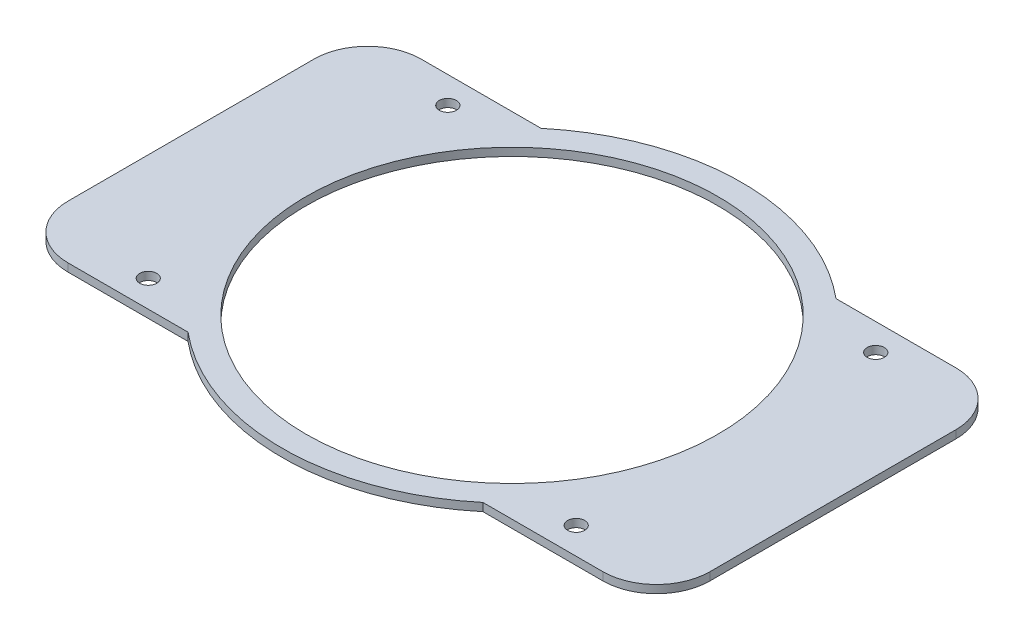
ISO-10303-21;
HEADER;
FILE_DESCRIPTION(('STEP AP214'),'2;1');
FILE_NAME('part.step','',(''),(''),'','','');
FILE_SCHEMA(('AUTOMOTIVE_DESIGN { 1 0 10303 214 1 1 1 1 }'));
ENDSEC;
DATA;
#1=APPLICATION_CONTEXT('core data for automotive mechanical design processes');
#2=APPLICATION_PROTOCOL_DEFINITION('international standard','automotive_design',2000,#1);
#3=PRODUCT_CONTEXT('',#1,'mechanical');
#4=PRODUCT('Part','Part','',(#3));
#5=PRODUCT_RELATED_PRODUCT_CATEGORY('part','',(#4));
#6=PRODUCT_DEFINITION_FORMATION('','',#4);
#7=PRODUCT_DEFINITION_CONTEXT('part definition',#1,'design');
#8=PRODUCT_DEFINITION('design','',#6,#7);
#9=PRODUCT_DEFINITION_SHAPE('','',#8);
#10=(LENGTH_UNIT() NAMED_UNIT(*) SI_UNIT(.MILLI.,.METRE.));
#11=(NAMED_UNIT(*) PLANE_ANGLE_UNIT() SI_UNIT($,.RADIAN.));
#12=(NAMED_UNIT(*) SI_UNIT($,.STERADIAN.) SOLID_ANGLE_UNIT());
#13=UNCERTAINTY_MEASURE_WITH_UNIT(LENGTH_MEASURE(1.E-05),#10,'distance_accuracy_value','');
#14=(GEOMETRIC_REPRESENTATION_CONTEXT(3) GLOBAL_UNCERTAINTY_ASSIGNED_CONTEXT((#13)) GLOBAL_UNIT_ASSIGNED_CONTEXT((#10,
#11,#12)) REPRESENTATION_CONTEXT('',''));
#15=CARTESIAN_POINT('',(0.,0.,0.));
#16=DIRECTION('',(0.,0.,1.));
#17=DIRECTION('',(1.,0.,0.));
#18=AXIS2_PLACEMENT_3D('',#15,#16,#17);
#19=CARTESIAN_POINT('',(0.,1.5,0.));
#20=DIRECTION('',(0.,1.,0.));
#21=DIRECTION('',(0.,0.,1.));
#22=AXIS2_PLACEMENT_3D('',#19,#20,#21);
#23=PLANE('',#22);
#24=CARTESIAN_POINT('',(-40.,1.5,-28.));
#25=DIRECTION('',(0.,1.,0.));
#26=DIRECTION('',(0.,0.,-1.));
#27=AXIS2_PLACEMENT_3D('',#24,#25,#26);
#28=CIRCLE('',#27,1.6);
#29=CARTESIAN_POINT('',(-40.,1.5,-29.6));
#30=VERTEX_POINT('',#29);
#31=EDGE_CURVE('E501',#30,#30,#28,.T.);
#32=ORIENTED_EDGE('',*,*,#31,.F.);
#33=EDGE_LOOP('',(#32));
#34=FACE_BOUND('',#33,.T.);
#35=CARTESIAN_POINT('',(-40.,1.5,28.));
#36=DIRECTION('',(0.,1.,0.));
#37=DIRECTION('',(0.,0.,1.));
#38=AXIS2_PLACEMENT_3D('',#35,#36,#37);
#39=CIRCLE('',#38,1.6);
#40=CARTESIAN_POINT('',(-40.,1.5,29.6));
#41=VERTEX_POINT('',#40);
#42=EDGE_CURVE('E495',#41,#41,#39,.T.);
#43=ORIENTED_EDGE('',*,*,#42,.F.);
#44=EDGE_LOOP('',(#43));
#45=FACE_BOUND('',#44,.T.);
#46=CARTESIAN_POINT('',(40.,1.5,28.));
#47=DIRECTION('',(0.,1.,0.));
#48=DIRECTION('',(0.,0.,-1.));
#49=AXIS2_PLACEMENT_3D('',#46,#47,#48);
#50=CIRCLE('',#49,1.6);
#51=CARTESIAN_POINT('',(40.,1.5,26.4));
#52=VERTEX_POINT('',#51);
#53=EDGE_CURVE('E485',#52,#52,#50,.T.);
#54=ORIENTED_EDGE('',*,*,#53,.F.);
#55=EDGE_LOOP('',(#54));
#56=FACE_BOUND('',#55,.T.);
#57=CARTESIAN_POINT('',(40.,1.5,-28.));
#58=DIRECTION('',(0.,1.,0.));
#59=DIRECTION('',(0.,0.,1.));
#60=AXIS2_PLACEMENT_3D('',#57,#58,#59);
#61=CIRCLE('',#60,1.6);
#62=CARTESIAN_POINT('',(40.,1.5,-26.4));
#63=VERTEX_POINT('',#62);
#64=EDGE_CURVE('E236',#63,#63,#61,.T.);
#65=ORIENTED_EDGE('',*,*,#64,.F.);
#66=EDGE_LOOP('',(#65));
#67=FACE_BOUND('',#66,.T.);
#68=DIRECTION('',(1.,0.,0.));
#69=VECTOR('',#68,1.);
#70=CARTESIAN_POINT('',(60.,1.5,33.));
#71=LINE('',#70,#69);
#72=CARTESIAN_POINT('',(27.5680975041804,1.5,33.));
#73=VERTEX_POINT('',#72);
#74=CARTESIAN_POINT('',(50.,1.5,33.));
#75=VERTEX_POINT('',#74);
#76=EDGE_CURVE('E159',#73,#75,#71,.T.);
#77=ORIENTED_EDGE('',*,*,#76,.T.);
#78=CARTESIAN_POINT('',(50.,1.5,23.));
#79=DIRECTION('',(0.,1.,0.));
#80=DIRECTION('',(0.,0.,1.));
#81=AXIS2_PLACEMENT_3D('',#78,#79,#80);
#82=CIRCLE('',#81,10.);
#83=CARTESIAN_POINT('',(60.,1.5,23.));
#84=VERTEX_POINT('',#83);
#85=EDGE_CURVE('E193',#75,#84,#82,.T.);
#86=ORIENTED_EDGE('',*,*,#85,.T.);
#87=DIRECTION('',(0.,0.,-1.));
#88=VECTOR('',#87,1.);
#89=CARTESIAN_POINT('',(60.,1.5,-32.));
#90=LINE('',#89,#88);
#91=CARTESIAN_POINT('',(60.,1.5,-23.));
#92=VERTEX_POINT('',#91);
#93=EDGE_CURVE('E167',#84,#92,#90,.T.);
#94=ORIENTED_EDGE('',*,*,#93,.T.);
#95=CARTESIAN_POINT('',(50.,1.5,-23.));
#96=DIRECTION('',(0.,1.,0.));
#97=DIRECTION('',(0.,0.,1.));
#98=AXIS2_PLACEMENT_3D('',#95,#96,#97);
#99=CIRCLE('',#98,10.);
#100=CARTESIAN_POINT('',(50.,1.5,-33.));
#101=VERTEX_POINT('',#100);
#102=EDGE_CURVE('E191',#92,#101,#99,.T.);
#103=ORIENTED_EDGE('',*,*,#102,.T.);
#104=DIRECTION('',(-1.,0.,0.));
#105=VECTOR('',#104,1.);
#106=CARTESIAN_POINT('',(60.,1.5,-33.));
#107=LINE('',#106,#105);
#108=CARTESIAN_POINT('',(27.5680975041804,1.5,-33.));
#109=VERTEX_POINT('',#108);
#110=EDGE_CURVE('E151',#101,#109,#107,.T.);
#111=ORIENTED_EDGE('',*,*,#110,.T.);
#112=CARTESIAN_POINT('',(0.,1.5,0.));
#113=DIRECTION('',(0.,1.,0.));
#114=DIRECTION('',(0.,0.,1.));
#115=AXIS2_PLACEMENT_3D('',#112,#113,#114);
#116=CIRCLE('',#115,43.);
#117=CARTESIAN_POINT('',(-27.5680975041804,1.5,-33.));
#118=VERTEX_POINT('',#117);
#119=EDGE_CURVE('E141',#109,#118,#116,.T.);
#120=ORIENTED_EDGE('',*,*,#119,.T.);
#121=DIRECTION('',(-1.,0.,0.));
#122=VECTOR('',#121,1.);
#123=CARTESIAN_POINT('',(-60.,1.5,-33.));
#124=LINE('',#123,#122);
#125=CARTESIAN_POINT('',(-50.,1.5,-33.));
#126=VERTEX_POINT('',#125);
#127=EDGE_CURVE('E222',#118,#126,#124,.T.);
#128=ORIENTED_EDGE('',*,*,#127,.T.);
#129=CARTESIAN_POINT('',(-50.,1.5,-23.));
#130=DIRECTION('',(0.,1.,0.));
#131=DIRECTION('',(0.,0.,1.));
#132=AXIS2_PLACEMENT_3D('',#129,#130,#131);
#133=CIRCLE('',#132,10.);
#134=CARTESIAN_POINT('',(-60.,1.5,-23.));
#135=VERTEX_POINT('',#134);
#136=EDGE_CURVE('E189',#126,#135,#133,.T.);
#137=ORIENTED_EDGE('',*,*,#136,.T.);
#138=DIRECTION('',(0.,0.,1.));
#139=VECTOR('',#138,1.);
#140=CARTESIAN_POINT('',(-60.,1.5,-32.));
#141=LINE('',#140,#139);
#142=CARTESIAN_POINT('',(-60.,1.5,23.));
#143=VERTEX_POINT('',#142);
#144=EDGE_CURVE('E145',#135,#143,#141,.T.);
#145=ORIENTED_EDGE('',*,*,#144,.T.);
#146=CARTESIAN_POINT('',(-50.,1.5,23.));
#147=DIRECTION('',(0.,1.,0.));
#148=DIRECTION('',(0.,0.,1.));
#149=AXIS2_PLACEMENT_3D('',#146,#147,#148);
#150=CIRCLE('',#149,10.);
#151=CARTESIAN_POINT('',(-50.,1.5,33.));
#152=VERTEX_POINT('',#151);
#153=EDGE_CURVE('E187',#143,#152,#150,.T.);
#154=ORIENTED_EDGE('',*,*,#153,.T.);
#155=DIRECTION('',(1.,0.,0.));
#156=VECTOR('',#155,1.);
#157=CARTESIAN_POINT('',(-60.,1.5,33.));
#158=LINE('',#157,#156);
#159=CARTESIAN_POINT('',(-27.5680975041804,1.5,33.));
#160=VERTEX_POINT('',#159);
#161=EDGE_CURVE('E229',#152,#160,#158,.T.);
#162=ORIENTED_EDGE('',*,*,#161,.T.);
#163=CARTESIAN_POINT('',(0.,1.5,0.));
#164=DIRECTION('',(0.,1.,0.));
#165=DIRECTION('',(0.,0.,1.));
#166=AXIS2_PLACEMENT_3D('',#163,#164,#165);
#167=CIRCLE('',#166,43.);
#168=EDGE_CURVE('E165',#160,#73,#167,.T.);
#169=ORIENTED_EDGE('',*,*,#168,.T.);
#170=EDGE_LOOP('',(#77,#86,#94,#103,#111,#120,#128,#137,#145,#154,#162,#169));
#171=FACE_BOUND('',#170,.T.);
#172=CARTESIAN_POINT('',(0.,1.5,0.));
#173=DIRECTION('',(0.,1.,0.));
#174=DIRECTION('',(0.,0.,1.));
#175=AXIS2_PLACEMENT_3D('',#172,#173,#174);
#176=CIRCLE('',#175,38.5);
#177=CARTESIAN_POINT('',(0.,1.5,38.5));
#178=VERTEX_POINT('',#177);
#179=EDGE_CURVE('E154',#178,#178,#176,.T.);
#180=ORIENTED_EDGE('',*,*,#179,.F.);
#181=EDGE_LOOP('',(#180));
#182=FACE_BOUND('',#181,.T.);
#183=ADVANCED_FACE('F33',(#34,#45,#56,#67,#171,#182),#23,.T.);
#184=CARTESIAN_POINT('',(0.,0.,0.));
#185=DIRECTION('',(0.,1.,0.));
#186=DIRECTION('',(0.,0.,1.));
#187=AXIS2_PLACEMENT_3D('',#184,#185,#186);
#188=PLANE('',#187);
#189=CARTESIAN_POINT('',(-40.,0.,-28.));
#190=DIRECTION('',(0.,1.,0.));
#191=DIRECTION('',(0.,0.,-1.));
#192=AXIS2_PLACEMENT_3D('',#189,#190,#191);
#193=CIRCLE('',#192,1.6);
#194=CARTESIAN_POINT('',(-40.,0.,-29.6));
#195=VERTEX_POINT('',#194);
#196=EDGE_CURVE('E498',#195,#195,#193,.T.);
#197=ORIENTED_EDGE('',*,*,#196,.T.);
#198=EDGE_LOOP('',(#197));
#199=FACE_BOUND('',#198,.T.);
#200=CARTESIAN_POINT('',(-40.,0.,28.));
#201=DIRECTION('',(0.,1.,0.));
#202=DIRECTION('',(0.,0.,1.));
#203=AXIS2_PLACEMENT_3D('',#200,#201,#202);
#204=CIRCLE('',#203,1.6);
#205=CARTESIAN_POINT('',(-40.,0.,29.6));
#206=VERTEX_POINT('',#205);
#207=EDGE_CURVE('E490',#206,#206,#204,.T.);
#208=ORIENTED_EDGE('',*,*,#207,.T.);
#209=EDGE_LOOP('',(#208));
#210=FACE_BOUND('',#209,.T.);
#211=CARTESIAN_POINT('',(40.,0.,28.));
#212=DIRECTION('',(0.,1.,0.));
#213=DIRECTION('',(0.,0.,-1.));
#214=AXIS2_PLACEMENT_3D('',#211,#212,#213);
#215=CIRCLE('',#214,1.6);
#216=CARTESIAN_POINT('',(40.,0.,26.4));
#217=VERTEX_POINT('',#216);
#218=EDGE_CURVE('E483',#217,#217,#215,.T.);
#219=ORIENTED_EDGE('',*,*,#218,.T.);
#220=EDGE_LOOP('',(#219));
#221=FACE_BOUND('',#220,.T.);
#222=CARTESIAN_POINT('',(40.,0.,-28.));
#223=DIRECTION('',(0.,1.,0.));
#224=DIRECTION('',(0.,0.,1.));
#225=AXIS2_PLACEMENT_3D('',#222,#223,#224);
#226=CIRCLE('',#225,1.6);
#227=CARTESIAN_POINT('',(40.,0.,-26.4));
#228=VERTEX_POINT('',#227);
#229=EDGE_CURVE('E233',#228,#228,#226,.T.);
#230=ORIENTED_EDGE('',*,*,#229,.T.);
#231=EDGE_LOOP('',(#230));
#232=FACE_BOUND('',#231,.T.);
#233=DIRECTION('',(0.,0.,-1.));
#234=VECTOR('',#233,1.);
#235=CARTESIAN_POINT('',(60.,0.,-32.));
#236=LINE('',#235,#234);
#237=CARTESIAN_POINT('',(60.,0.,23.));
#238=VERTEX_POINT('',#237);
#239=CARTESIAN_POINT('',(60.,0.,-23.));
#240=VERTEX_POINT('',#239);
#241=EDGE_CURVE('E134',#238,#240,#236,.T.);
#242=ORIENTED_EDGE('',*,*,#241,.F.);
#243=CARTESIAN_POINT('',(50.,0.,23.));
#244=DIRECTION('',(0.,1.,0.));
#245=DIRECTION('',(0.,0.,1.));
#246=AXIS2_PLACEMENT_3D('',#243,#244,#245);
#247=CIRCLE('',#246,10.);
#248=CARTESIAN_POINT('',(50.,0.,33.));
#249=VERTEX_POINT('',#248);
#250=EDGE_CURVE('E205',#238,#249,#247,.F.);
#251=ORIENTED_EDGE('',*,*,#250,.T.);
#252=DIRECTION('',(-1.,0.,0.));
#253=VECTOR('',#252,1.);
#254=CARTESIAN_POINT('',(60.,0.,33.));
#255=LINE('',#254,#253);
#256=CARTESIAN_POINT('',(27.5680975041804,0.,33.));
#257=VERTEX_POINT('',#256);
#258=EDGE_CURVE('E156',#249,#257,#255,.T.);
#259=ORIENTED_EDGE('',*,*,#258,.T.);
#260=CARTESIAN_POINT('',(0.,0.,0.));
#261=DIRECTION('',(0.,1.,0.));
#262=DIRECTION('',(0.,0.,1.));
#263=AXIS2_PLACEMENT_3D('',#260,#261,#262);
#264=CIRCLE('',#263,43.);
#265=CARTESIAN_POINT('',(-27.5680975041804,0.,33.));
#266=VERTEX_POINT('',#265);
#267=EDGE_CURVE('E163',#266,#257,#264,.T.);
#268=ORIENTED_EDGE('',*,*,#267,.F.);
#269=DIRECTION('',(-1.,0.,0.));
#270=VECTOR('',#269,1.);
#271=CARTESIAN_POINT('',(-60.,0.,33.));
#272=LINE('',#271,#270);
#273=CARTESIAN_POINT('',(-50.,0.,33.));
#274=VERTEX_POINT('',#273);
#275=EDGE_CURVE('E231',#266,#274,#272,.T.);
#276=ORIENTED_EDGE('',*,*,#275,.T.);
#277=CARTESIAN_POINT('',(-50.,0.,23.));
#278=DIRECTION('',(0.,1.,0.));
#279=DIRECTION('',(0.,0.,1.));
#280=AXIS2_PLACEMENT_3D('',#277,#278,#279);
#281=CIRCLE('',#280,10.);
#282=CARTESIAN_POINT('',(-60.,0.,23.));
#283=VERTEX_POINT('',#282);
#284=EDGE_CURVE('E48',#274,#283,#281,.F.);
#285=ORIENTED_EDGE('',*,*,#284,.T.);
#286=DIRECTION('',(0.,0.,1.));
#287=VECTOR('',#286,1.);
#288=CARTESIAN_POINT('',(-60.,0.,-32.));
#289=LINE('',#288,#287);
#290=CARTESIAN_POINT('',(-60.,0.,-23.));
#291=VERTEX_POINT('',#290);
#292=EDGE_CURVE('E133',#291,#283,#289,.T.);
#293=ORIENTED_EDGE('',*,*,#292,.F.);
#294=CARTESIAN_POINT('',(-50.,0.,-23.));
#295=DIRECTION('',(0.,1.,0.));
#296=DIRECTION('',(0.,0.,1.));
#297=AXIS2_PLACEMENT_3D('',#294,#295,#296);
#298=CIRCLE('',#297,10.);
#299=CARTESIAN_POINT('',(-50.,0.,-33.));
#300=VERTEX_POINT('',#299);
#301=EDGE_CURVE('E201',#291,#300,#298,.F.);
#302=ORIENTED_EDGE('',*,*,#301,.T.);
#303=DIRECTION('',(1.,0.,0.));
#304=VECTOR('',#303,1.);
#305=CARTESIAN_POINT('',(-60.,0.,-33.));
#306=LINE('',#305,#304);
#307=CARTESIAN_POINT('',(-27.5680975041804,0.,-33.));
#308=VERTEX_POINT('',#307);
#309=EDGE_CURVE('E130',#300,#308,#306,.T.);
#310=ORIENTED_EDGE('',*,*,#309,.T.);
#311=CARTESIAN_POINT('',(0.,0.,0.));
#312=DIRECTION('',(0.,1.,0.));
#313=DIRECTION('',(0.,0.,1.));
#314=AXIS2_PLACEMENT_3D('',#311,#312,#313);
#315=CIRCLE('',#314,43.);
#316=CARTESIAN_POINT('',(27.5680975041804,0.,-33.));
#317=VERTEX_POINT('',#316);
#318=EDGE_CURVE('E121',#317,#308,#315,.T.);
#319=ORIENTED_EDGE('',*,*,#318,.F.);
#320=DIRECTION('',(1.,0.,0.));
#321=VECTOR('',#320,1.);
#322=CARTESIAN_POINT('',(60.,0.,-33.));
#323=LINE('',#322,#321);
#324=CARTESIAN_POINT('',(50.,0.,-33.));
#325=VERTEX_POINT('',#324);
#326=EDGE_CURVE('E127',#317,#325,#323,.T.);
#327=ORIENTED_EDGE('',*,*,#326,.T.);
#328=CARTESIAN_POINT('',(50.,0.,-23.));
#329=DIRECTION('',(0.,1.,0.));
#330=DIRECTION('',(0.,0.,1.));
#331=AXIS2_PLACEMENT_3D('',#328,#329,#330);
#332=CIRCLE('',#331,10.);
#333=EDGE_CURVE('E203',#325,#240,#332,.F.);
#334=ORIENTED_EDGE('',*,*,#333,.T.);
#335=EDGE_LOOP('',(#242,#251,#259,#268,#276,#285,#293,#302,#310,#319,#327,#334));
#336=FACE_BOUND('',#335,.T.);
#337=CARTESIAN_POINT('',(0.,0.,0.));
#338=DIRECTION('',(0.,1.,0.));
#339=DIRECTION('',(0.,0.,1.));
#340=AXIS2_PLACEMENT_3D('',#337,#338,#339);
#341=CIRCLE('',#340,38.5);
#342=CARTESIAN_POINT('',(0.,0.,38.5));
#343=VERTEX_POINT('',#342);
#344=EDGE_CURVE('E150',#343,#343,#341,.T.);
#345=ORIENTED_EDGE('',*,*,#344,.T.);
#346=EDGE_LOOP('',(#345));
#347=FACE_BOUND('',#346,.T.);
#348=ADVANCED_FACE('F124',(#199,#210,#221,#232,#336,#347),#188,.F.);
#349=CARTESIAN_POINT('',(0.,1.5,0.));
#350=DIRECTION('',(0.,-1.,0.));
#351=DIRECTION('',(0.,0.,-1.));
#352=AXIS2_PLACEMENT_3D('',#349,#350,#351);
#353=CYLINDRICAL_SURFACE('',#352,43.);
#354=ORIENTED_EDGE('',*,*,#168,.F.);
#355=DIRECTION('',(0.,-1.,0.));
#356=VECTOR('',#355,1.);
#357=CARTESIAN_POINT('',(-27.5680975041804,1.5,33.));
#358=LINE('',#357,#356);
#359=EDGE_CURVE('E180',#160,#266,#358,.T.);
#360=ORIENTED_EDGE('',*,*,#359,.T.);
#361=ORIENTED_EDGE('',*,*,#267,.T.);
#362=DIRECTION('',(0.,-1.,0.));
#363=VECTOR('',#362,1.);
#364=CARTESIAN_POINT('',(27.5680975041804,1.5,33.));
#365=LINE('',#364,#363);
#366=EDGE_CURVE('E144',#257,#73,#365,.F.);
#367=ORIENTED_EDGE('',*,*,#366,.T.);
#368=EDGE_LOOP('',(#354,#360,#361,#367));
#369=FACE_BOUND('',#368,.T.);
#370=ADVANCED_FACE('F271',(#369),#353,.T.);
#371=CARTESIAN_POINT('',(60.,1.5,-32.));
#372=DIRECTION('',(-1.,0.,0.));
#373=DIRECTION('',(0.,0.,1.));
#374=AXIS2_PLACEMENT_3D('',#371,#372,#373);
#375=PLANE('',#374);
#376=ORIENTED_EDGE('',*,*,#93,.F.);
#377=DIRECTION('',(0.,1.,0.));
#378=VECTOR('',#377,1.);
#379=CARTESIAN_POINT('',(60.,0.,23.));
#380=LINE('',#379,#378);
#381=EDGE_CURVE('E198',#84,#238,#380,.F.);
#382=ORIENTED_EDGE('',*,*,#381,.T.);
#383=ORIENTED_EDGE('',*,*,#241,.T.);
#384=DIRECTION('',(0.,1.,0.));
#385=VECTOR('',#384,1.);
#386=CARTESIAN_POINT('',(60.,1.5,-23.));
#387=LINE('',#386,#385);
#388=EDGE_CURVE('E195',#240,#92,#387,.T.);
#389=ORIENTED_EDGE('',*,*,#388,.T.);
#390=EDGE_LOOP('',(#376,#382,#383,#389));
#391=FACE_BOUND('',#390,.T.);
#392=ADVANCED_FACE('F253',(#391),#375,.F.);
#393=CARTESIAN_POINT('',(0.,1.5,0.));
#394=DIRECTION('',(0.,-1.,0.));
#395=DIRECTION('',(0.,0.,-1.));
#396=AXIS2_PLACEMENT_3D('',#393,#394,#395);
#397=CYLINDRICAL_SURFACE('',#396,43.);
#398=ORIENTED_EDGE('',*,*,#318,.T.);
#399=DIRECTION('',(0.,-1.,0.));
#400=VECTOR('',#399,1.);
#401=CARTESIAN_POINT('',(-27.5680975041804,1.5,-33.));
#402=LINE('',#401,#400);
#403=EDGE_CURVE('E182',#308,#118,#402,.F.);
#404=ORIENTED_EDGE('',*,*,#403,.T.);
#405=ORIENTED_EDGE('',*,*,#119,.F.);
#406=DIRECTION('',(0.,-1.,0.));
#407=VECTOR('',#406,1.);
#408=CARTESIAN_POINT('',(27.5680975041804,1.5,-33.));
#409=LINE('',#408,#407);
#410=EDGE_CURVE('E138',#109,#317,#409,.T.);
#411=ORIENTED_EDGE('',*,*,#410,.T.);
#412=EDGE_LOOP('',(#398,#404,#405,#411));
#413=FACE_BOUND('',#412,.T.);
#414=ADVANCED_FACE('F139',(#413),#397,.T.);
#415=CARTESIAN_POINT('',(-60.,1.5,-32.));
#416=DIRECTION('',(1.,0.,0.));
#417=DIRECTION('',(0.,0.,-1.));
#418=AXIS2_PLACEMENT_3D('',#415,#416,#417);
#419=PLANE('',#418);
#420=ORIENTED_EDGE('',*,*,#144,.F.);
#421=DIRECTION('',(0.,1.,0.));
#422=VECTOR('',#421,1.);
#423=CARTESIAN_POINT('',(-60.,0.,-23.));
#424=LINE('',#423,#422);
#425=EDGE_CURVE('E41',#135,#291,#424,.F.);
#426=ORIENTED_EDGE('',*,*,#425,.T.);
#427=ORIENTED_EDGE('',*,*,#292,.T.);
#428=DIRECTION('',(0.,1.,0.));
#429=VECTOR('',#428,1.);
#430=CARTESIAN_POINT('',(-60.,1.5,23.));
#431=LINE('',#430,#429);
#432=EDGE_CURVE('E211',#283,#143,#431,.T.);
#433=ORIENTED_EDGE('',*,*,#432,.T.);
#434=EDGE_LOOP('',(#420,#426,#427,#433));
#435=FACE_BOUND('',#434,.T.);
#436=ADVANCED_FACE('F214',(#435),#419,.F.);
#437=CARTESIAN_POINT('',(0.,1.5,0.));
#438=DIRECTION('',(0.,-1.,0.));
#439=DIRECTION('',(0.,0.,-1.));
#440=AXIS2_PLACEMENT_3D('',#437,#438,#439);
#441=CYLINDRICAL_SURFACE('',#440,38.5);
#442=ORIENTED_EDGE('',*,*,#179,.T.);
#443=EDGE_LOOP('',(#442));
#444=FACE_BOUND('',#443,.T.);
#445=ORIENTED_EDGE('',*,*,#344,.F.);
#446=EDGE_LOOP('',(#445));
#447=FACE_BOUND('',#446,.T.);
#448=ADVANCED_FACE('F277',(#444,#447),#441,.F.);
#449=CARTESIAN_POINT('',(60.,-39.0862626355057,-33.));
#450=DIRECTION('',(0.,0.,-1.));
#451=DIRECTION('',(-1.,0.,0.));
#452=AXIS2_PLACEMENT_3D('',#449,#450,#451);
#453=PLANE('',#452);
#454=ORIENTED_EDGE('',*,*,#110,.F.);
#455=DIRECTION('',(0.,1.,0.));
#456=VECTOR('',#455,1.);
#457=CARTESIAN_POINT('',(50.,0.,-33.));
#458=LINE('',#457,#456);
#459=EDGE_CURVE('E149',#101,#325,#458,.F.);
#460=ORIENTED_EDGE('',*,*,#459,.T.);
#461=ORIENTED_EDGE('',*,*,#326,.F.);
#462=ORIENTED_EDGE('',*,*,#410,.F.);
#463=EDGE_LOOP('',(#454,#460,#461,#462));
#464=FACE_BOUND('',#463,.T.);
#465=ADVANCED_FACE('F147',(#464),#453,.T.);
#466=CARTESIAN_POINT('',(60.,-39.0862626355057,33.));
#467=DIRECTION('',(0.,0.,1.));
#468=DIRECTION('',(1.,0.,0.));
#469=AXIS2_PLACEMENT_3D('',#466,#467,#468);
#470=PLANE('',#469);
#471=ORIENTED_EDGE('',*,*,#258,.F.);
#472=DIRECTION('',(0.,1.,0.));
#473=VECTOR('',#472,1.);
#474=CARTESIAN_POINT('',(50.,1.5,33.));
#475=LINE('',#474,#473);
#476=EDGE_CURVE('E184',#249,#75,#475,.T.);
#477=ORIENTED_EDGE('',*,*,#476,.T.);
#478=ORIENTED_EDGE('',*,*,#76,.F.);
#479=ORIENTED_EDGE('',*,*,#366,.F.);
#480=EDGE_LOOP('',(#471,#477,#478,#479));
#481=FACE_BOUND('',#480,.T.);
#482=ADVANCED_FACE('F246',(#481),#470,.T.);
#483=CARTESIAN_POINT('',(-60.,-39.0862626355057,33.));
#484=DIRECTION('',(0.,0.,1.));
#485=DIRECTION('',(1.,0.,0.));
#486=AXIS2_PLACEMENT_3D('',#483,#484,#485);
#487=PLANE('',#486);
#488=ORIENTED_EDGE('',*,*,#161,.F.);
#489=DIRECTION('',(0.,1.,0.));
#490=VECTOR('',#489,1.);
#491=CARTESIAN_POINT('',(-50.,0.,33.));
#492=LINE('',#491,#490);
#493=EDGE_CURVE('E11',#152,#274,#492,.F.);
#494=ORIENTED_EDGE('',*,*,#493,.T.);
#495=ORIENTED_EDGE('',*,*,#275,.F.);
#496=ORIENTED_EDGE('',*,*,#359,.F.);
#497=EDGE_LOOP('',(#488,#494,#495,#496));
#498=FACE_BOUND('',#497,.T.);
#499=ADVANCED_FACE('F293',(#498),#487,.T.);
#500=CARTESIAN_POINT('',(-60.,-39.0862626355057,-33.));
#501=DIRECTION('',(0.,0.,-1.));
#502=DIRECTION('',(-1.,0.,0.));
#503=AXIS2_PLACEMENT_3D('',#500,#501,#502);
#504=PLANE('',#503);
#505=ORIENTED_EDGE('',*,*,#309,.F.);
#506=DIRECTION('',(0.,1.,0.));
#507=VECTOR('',#506,1.);
#508=CARTESIAN_POINT('',(-50.,1.5,-33.));
#509=LINE('',#508,#507);
#510=EDGE_CURVE('E208',#300,#126,#509,.T.);
#511=ORIENTED_EDGE('',*,*,#510,.T.);
#512=ORIENTED_EDGE('',*,*,#127,.F.);
#513=ORIENTED_EDGE('',*,*,#403,.F.);
#514=EDGE_LOOP('',(#505,#511,#512,#513));
#515=FACE_BOUND('',#514,.T.);
#516=ADVANCED_FACE('F228',(#515),#504,.T.);
#517=CARTESIAN_POINT('',(40.,0.,-28.));
#518=DIRECTION('',(0.,1.,0.));
#519=DIRECTION('',(0.,0.,1.));
#520=AXIS2_PLACEMENT_3D('',#517,#518,#519);
#521=CYLINDRICAL_SURFACE('',#520,1.6);
#522=ORIENTED_EDGE('',*,*,#229,.F.);
#523=EDGE_LOOP('',(#522));
#524=FACE_BOUND('',#523,.T.);
#525=ORIENTED_EDGE('',*,*,#64,.T.);
#526=EDGE_LOOP('',(#525));
#527=FACE_BOUND('',#526,.T.);
#528=ADVANCED_FACE('F323',(#524,#527),#521,.F.);
#529=CARTESIAN_POINT('',(40.,0.,28.));
#530=DIRECTION('',(0.,1.,0.));
#531=DIRECTION('',(0.,0.,1.));
#532=AXIS2_PLACEMENT_3D('',#529,#530,#531);
#533=CYLINDRICAL_SURFACE('',#532,1.6);
#534=ORIENTED_EDGE('',*,*,#218,.F.);
#535=EDGE_LOOP('',(#534));
#536=FACE_BOUND('',#535,.T.);
#537=ORIENTED_EDGE('',*,*,#53,.T.);
#538=EDGE_LOOP('',(#537));
#539=FACE_BOUND('',#538,.T.);
#540=ADVANCED_FACE('F395',(#536,#539),#533,.F.);
#541=CARTESIAN_POINT('',(-40.,0.,28.));
#542=DIRECTION('',(0.,1.,0.));
#543=DIRECTION('',(0.,0.,1.));
#544=AXIS2_PLACEMENT_3D('',#541,#542,#543);
#545=CYLINDRICAL_SURFACE('',#544,1.6);
#546=ORIENTED_EDGE('',*,*,#207,.F.);
#547=EDGE_LOOP('',(#546));
#548=FACE_BOUND('',#547,.T.);
#549=ORIENTED_EDGE('',*,*,#42,.T.);
#550=EDGE_LOOP('',(#549));
#551=FACE_BOUND('',#550,.T.);
#552=ADVANCED_FACE('F385',(#548,#551),#545,.F.);
#553=CARTESIAN_POINT('',(-40.,0.,-28.));
#554=DIRECTION('',(0.,1.,0.));
#555=DIRECTION('',(0.,0.,1.));
#556=AXIS2_PLACEMENT_3D('',#553,#554,#555);
#557=CYLINDRICAL_SURFACE('',#556,1.6);
#558=ORIENTED_EDGE('',*,*,#196,.F.);
#559=EDGE_LOOP('',(#558));
#560=FACE_BOUND('',#559,.T.);
#561=ORIENTED_EDGE('',*,*,#31,.T.);
#562=EDGE_LOOP('',(#561));
#563=FACE_BOUND('',#562,.T.);
#564=ADVANCED_FACE('F263',(#560,#563),#557,.F.);
#565=CARTESIAN_POINT('',(50.,-39.0862626355057,23.));
#566=DIRECTION('',(0.,-1.,0.));
#567=DIRECTION('',(0.,0.,-1.));
#568=AXIS2_PLACEMENT_3D('',#565,#566,#567);
#569=CYLINDRICAL_SURFACE('',#568,10.);
#570=ORIENTED_EDGE('',*,*,#250,.F.);
#571=ORIENTED_EDGE('',*,*,#381,.F.);
#572=ORIENTED_EDGE('',*,*,#85,.F.);
#573=ORIENTED_EDGE('',*,*,#476,.F.);
#574=EDGE_LOOP('',(#570,#571,#572,#573));
#575=FACE_BOUND('',#574,.T.);
#576=ADVANCED_FACE('F250',(#575),#569,.T.);
#577=CARTESIAN_POINT('',(50.,1.5,-23.));
#578=DIRECTION('',(0.,-1.,0.));
#579=DIRECTION('',(0.,0.,-1.));
#580=AXIS2_PLACEMENT_3D('',#577,#578,#579);
#581=CYLINDRICAL_SURFACE('',#580,10.);
#582=ORIENTED_EDGE('',*,*,#333,.F.);
#583=ORIENTED_EDGE('',*,*,#459,.F.);
#584=ORIENTED_EDGE('',*,*,#102,.F.);
#585=ORIENTED_EDGE('',*,*,#388,.F.);
#586=EDGE_LOOP('',(#582,#583,#584,#585));
#587=FACE_BOUND('',#586,.T.);
#588=ADVANCED_FACE('F256',(#587),#581,.T.);
#589=CARTESIAN_POINT('',(-50.,-39.0862626355057,-23.));
#590=DIRECTION('',(0.,-1.,0.));
#591=DIRECTION('',(0.,0.,-1.));
#592=AXIS2_PLACEMENT_3D('',#589,#590,#591);
#593=CYLINDRICAL_SURFACE('',#592,10.);
#594=ORIENTED_EDGE('',*,*,#301,.F.);
#595=ORIENTED_EDGE('',*,*,#425,.F.);
#596=ORIENTED_EDGE('',*,*,#136,.F.);
#597=ORIENTED_EDGE('',*,*,#510,.F.);
#598=EDGE_LOOP('',(#594,#595,#596,#597));
#599=FACE_BOUND('',#598,.T.);
#600=ADVANCED_FACE('F226',(#599),#593,.T.);
#601=CARTESIAN_POINT('',(-50.,1.5,23.));
#602=DIRECTION('',(0.,-1.,0.));
#603=DIRECTION('',(0.,0.,-1.));
#604=AXIS2_PLACEMENT_3D('',#601,#602,#603);
#605=CYLINDRICAL_SURFACE('',#604,10.);
#606=ORIENTED_EDGE('',*,*,#284,.F.);
#607=ORIENTED_EDGE('',*,*,#493,.F.);
#608=ORIENTED_EDGE('',*,*,#153,.F.);
#609=ORIENTED_EDGE('',*,*,#432,.F.);
#610=EDGE_LOOP('',(#606,#607,#608,#609));
#611=FACE_BOUND('',#610,.T.);
#612=ADVANCED_FACE('F35',(#611),#605,.T.);
#613=CLOSED_SHELL('',(#183,#348,#370,#392,#414,#436,#448,#465,#482,#499,#516,#528,#540,#552,
#564,#576,#588,#600,#612));
#614=MANIFOLD_SOLID_BREP('B2',#613);
#615=ADVANCED_BREP_SHAPE_REPRESENTATION('',(#18,#614),#14);
#616=SHAPE_DEFINITION_REPRESENTATION(#9,#615);
ENDSEC;
END-ISO-10303-21;
